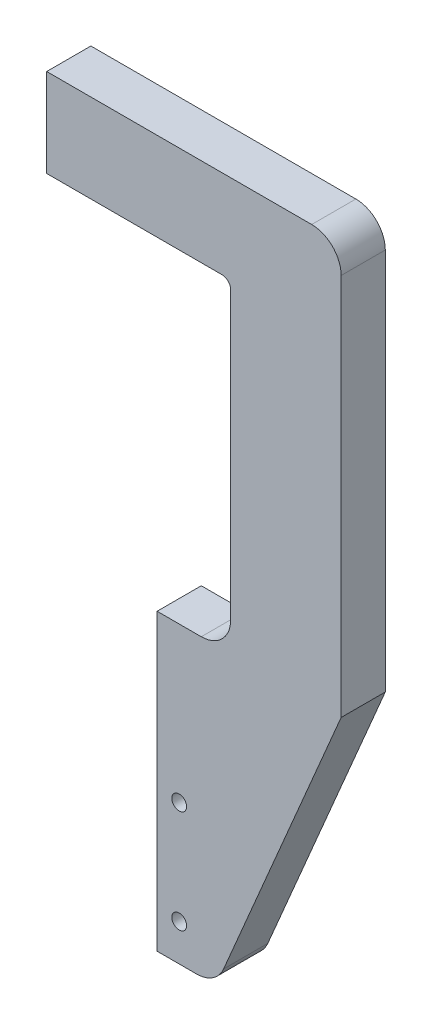
ISO-10303-21;
HEADER;
FILE_DESCRIPTION(('STEP AP214'),'2;1');
FILE_NAME('part.step','',(''),(''),'','','');
FILE_SCHEMA(('AUTOMOTIVE_DESIGN { 1 0 10303 214 1 1 1 1 }'));
ENDSEC;
DATA;
#1=APPLICATION_CONTEXT('core data for automotive mechanical design processes');
#2=APPLICATION_PROTOCOL_DEFINITION('international standard','automotive_design',2000,#1);
#3=PRODUCT_CONTEXT('',#1,'mechanical');
#4=PRODUCT('Part','Part','',(#3));
#5=PRODUCT_RELATED_PRODUCT_CATEGORY('part','',(#4));
#6=PRODUCT_DEFINITION_FORMATION('','',#4);
#7=PRODUCT_DEFINITION_CONTEXT('part definition',#1,'design');
#8=PRODUCT_DEFINITION('design','',#6,#7);
#9=PRODUCT_DEFINITION_SHAPE('','',#8);
#10=(LENGTH_UNIT() NAMED_UNIT(*) SI_UNIT(.MILLI.,.METRE.));
#11=(NAMED_UNIT(*) PLANE_ANGLE_UNIT() SI_UNIT($,.RADIAN.));
#12=(NAMED_UNIT(*) SI_UNIT($,.STERADIAN.) SOLID_ANGLE_UNIT());
#13=UNCERTAINTY_MEASURE_WITH_UNIT(LENGTH_MEASURE(1.E-05),#10,'distance_accuracy_value','');
#14=(GEOMETRIC_REPRESENTATION_CONTEXT(3) GLOBAL_UNCERTAINTY_ASSIGNED_CONTEXT((#13)) GLOBAL_UNIT_ASSIGNED_CONTEXT((#10,
#11,#12)) REPRESENTATION_CONTEXT('',''));
#15=CARTESIAN_POINT('',(0.,0.,0.));
#16=DIRECTION('',(0.,0.,1.));
#17=DIRECTION('',(1.,0.,0.));
#18=AXIS2_PLACEMENT_3D('',#15,#16,#17);
#19=CARTESIAN_POINT('',(0.,0.,7.5));
#20=DIRECTION('',(0.,1.,0.));
#21=DIRECTION('',(0.,0.,1.));
#22=AXIS2_PLACEMENT_3D('',#19,#20,#21);
#23=PLANE('',#22);
#24=CARTESIAN_POINT('',(40.,0.,0.));
#25=DIRECTION('',(0.,-1.,0.));
#26=DIRECTION('',(0.,0.,-1.));
#27=AXIS2_PLACEMENT_3D('',#24,#25,#26);
#28=CIRCLE('',#27,3.39999999999999);
#29=CARTESIAN_POINT('',(40.,0.,-3.39999999999999));
#30=VERTEX_POINT('',#29);
#31=EDGE_CURVE('E166',#30,#30,#28,.T.);
#32=ORIENTED_EDGE('',*,*,#31,.F.);
#33=EDGE_LOOP('',(#32));
#34=FACE_BOUND('',#33,.T.);
#35=CARTESIAN_POINT('',(10.,0.,0.));
#36=DIRECTION('',(0.,-1.,0.));
#37=DIRECTION('',(0.,0.,-1.));
#38=AXIS2_PLACEMENT_3D('',#35,#36,#37);
#39=CIRCLE('',#38,3.39999999999999);
#40=CARTESIAN_POINT('',(10.,0.,-3.39999999999999));
#41=VERTEX_POINT('',#40);
#42=EDGE_CURVE('E172',#41,#41,#39,.T.);
#43=ORIENTED_EDGE('',*,*,#42,.F.);
#44=EDGE_LOOP('',(#43));
#45=FACE_BOUND('',#44,.T.);
#46=DIRECTION('',(1.,0.,0.));
#47=VECTOR('',#46,1.);
#48=CARTESIAN_POINT('',(0.,0.,-7.5));
#49=LINE('',#48,#47);
#50=CARTESIAN_POINT('',(0.,0.,-7.5));
#51=VERTEX_POINT('',#50);
#52=CARTESIAN_POINT('',(59.5,0.,-7.5));
#53=VERTEX_POINT('',#52);
#54=EDGE_CURVE('E178',#51,#53,#49,.T.);
#55=ORIENTED_EDGE('',*,*,#54,.T.);
#56=DIRECTION('',(0.,0.,-1.));
#57=VECTOR('',#56,1.);
#58=CARTESIAN_POINT('',(59.5,0.,7.5));
#59=LINE('',#58,#57);
#60=CARTESIAN_POINT('',(59.5,0.,7.5));
#61=VERTEX_POINT('',#60);
#62=EDGE_CURVE('E53',#53,#61,#59,.F.);
#63=ORIENTED_EDGE('',*,*,#62,.T.);
#64=DIRECTION('',(1.,0.,0.));
#65=VECTOR('',#64,1.);
#66=CARTESIAN_POINT('',(0.,0.,7.5));
#67=LINE('',#66,#65);
#68=CARTESIAN_POINT('',(0.,0.,7.5));
#69=VERTEX_POINT('',#68);
#70=EDGE_CURVE('E179',#69,#61,#67,.T.);
#71=ORIENTED_EDGE('',*,*,#70,.F.);
#72=DIRECTION('',(0.,0.,-1.));
#73=VECTOR('',#72,1.);
#74=CARTESIAN_POINT('',(0.,0.,7.5));
#75=LINE('',#74,#73);
#76=EDGE_CURVE('E201',#69,#51,#75,.T.);
#77=ORIENTED_EDGE('',*,*,#76,.T.);
#78=EDGE_LOOP('',(#55,#63,#71,#77));
#79=FACE_BOUND('',#78,.T.);
#80=ADVANCED_FACE('F38',(#34,#45,#79),#23,.F.);
#81=CARTESIAN_POINT('',(62.5,-110.,7.5));
#82=DIRECTION('',(1.,0.,0.));
#83=DIRECTION('',(0.,1.,0.));
#84=AXIS2_PLACEMENT_3D('',#81,#82,#83);
#85=PLANE('',#84);
#86=DIRECTION('',(0.,-1.,0.));
#87=VECTOR('',#86,1.);
#88=CARTESIAN_POINT('',(62.5,-110.,7.5));
#89=LINE('',#88,#87);
#90=CARTESIAN_POINT('',(62.5,-3.,7.5));
#91=VERTEX_POINT('',#90);
#92=CARTESIAN_POINT('',(62.5,-100.,7.5));
#93=VERTEX_POINT('',#92);
#94=EDGE_CURVE('E181',#91,#93,#89,.T.);
#95=ORIENTED_EDGE('',*,*,#94,.F.);
#96=DIRECTION('',(0.,0.,-1.));
#97=VECTOR('',#96,1.);
#98=CARTESIAN_POINT('',(62.5,-3.,-7.5));
#99=LINE('',#98,#97);
#100=CARTESIAN_POINT('',(62.5,-3.,-7.5));
#101=VERTEX_POINT('',#100);
#102=EDGE_CURVE('E261',#91,#101,#99,.T.);
#103=ORIENTED_EDGE('',*,*,#102,.T.);
#104=DIRECTION('',(0.,-1.,0.));
#105=VECTOR('',#104,1.);
#106=CARTESIAN_POINT('',(62.5,-110.,-7.5));
#107=LINE('',#106,#105);
#108=CARTESIAN_POINT('',(62.5,-100.,-7.5));
#109=VERTEX_POINT('',#108);
#110=EDGE_CURVE('E203',#101,#109,#107,.T.);
#111=ORIENTED_EDGE('',*,*,#110,.T.);
#112=DIRECTION('',(0.,0.,-1.));
#113=VECTOR('',#112,1.);
#114=CARTESIAN_POINT('',(62.5,-100.,7.5));
#115=LINE('',#114,#113);
#116=EDGE_CURVE('E253',#109,#93,#115,.F.);
#117=ORIENTED_EDGE('',*,*,#116,.T.);
#118=EDGE_LOOP('',(#95,#103,#111,#117));
#119=FACE_BOUND('',#118,.T.);
#120=ADVANCED_FACE('F267',(#119),#85,.F.);
#121=CARTESIAN_POINT('',(62.5,-110.,7.5));
#122=DIRECTION('',(0.,-1.,0.));
#123=DIRECTION('',(1.,0.,0.));
#124=AXIS2_PLACEMENT_3D('',#121,#122,#123);
#125=PLANE('',#124);
#126=DIRECTION('',(-1.,0.,0.));
#127=VECTOR('',#126,1.);
#128=CARTESIAN_POINT('',(62.5,-110.,7.5));
#129=LINE('',#128,#127);
#130=CARTESIAN_POINT('',(52.5,-110.,7.5));
#131=VERTEX_POINT('',#130);
#132=CARTESIAN_POINT('',(37.5,-110.,7.5));
#133=VERTEX_POINT('',#132);
#134=EDGE_CURVE('E184',#131,#133,#129,.T.);
#135=ORIENTED_EDGE('',*,*,#134,.F.);
#136=DIRECTION('',(0.,0.,-1.));
#137=VECTOR('',#136,1.);
#138=CARTESIAN_POINT('',(52.5,-110.,-7.5));
#139=LINE('',#138,#137);
#140=CARTESIAN_POINT('',(52.5,-110.,-7.5));
#141=VERTEX_POINT('',#140);
#142=EDGE_CURVE('E250',#131,#141,#139,.T.);
#143=ORIENTED_EDGE('',*,*,#142,.T.);
#144=DIRECTION('',(-1.,0.,0.));
#145=VECTOR('',#144,1.);
#146=CARTESIAN_POINT('',(62.5,-110.,-7.5));
#147=LINE('',#146,#145);
#148=CARTESIAN_POINT('',(37.5,-110.,-7.5));
#149=VERTEX_POINT('',#148);
#150=EDGE_CURVE('E205',#141,#149,#147,.T.);
#151=ORIENTED_EDGE('',*,*,#150,.T.);
#152=DIRECTION('',(0.,0.,-1.));
#153=VECTOR('',#152,1.);
#154=CARTESIAN_POINT('',(37.5,-110.,7.5));
#155=LINE('',#154,#153);
#156=EDGE_CURVE('E238',#133,#149,#155,.T.);
#157=ORIENTED_EDGE('',*,*,#156,.F.);
#158=EDGE_LOOP('',(#135,#143,#151,#157));
#159=FACE_BOUND('',#158,.T.);
#160=ADVANCED_FACE('F284',(#159),#125,.F.);
#161=CARTESIAN_POINT('',(37.5,-110.,7.5));
#162=DIRECTION('',(1.,0.,0.));
#163=DIRECTION('',(0.,1.,0.));
#164=AXIS2_PLACEMENT_3D('',#161,#162,#163);
#165=PLANE('',#164);
#166=CARTESIAN_POINT('',(37.5,-130.,0.));
#167=DIRECTION('',(-1.,0.,0.));
#168=DIRECTION('',(0.,0.,1.));
#169=AXIS2_PLACEMENT_3D('',#166,#167,#168);
#170=CIRCLE('',#169,3.39999999999999);
#171=CARTESIAN_POINT('',(37.5,-130.,3.4));
#172=VERTEX_POINT('',#171);
#173=EDGE_CURVE('E154',#172,#172,#170,.T.);
#174=ORIENTED_EDGE('',*,*,#173,.F.);
#175=EDGE_LOOP('',(#174));
#176=FACE_BOUND('',#175,.T.);
#177=CARTESIAN_POINT('',(37.5,-190.,0.));
#178=DIRECTION('',(-1.,0.,0.));
#179=DIRECTION('',(0.,0.,1.));
#180=AXIS2_PLACEMENT_3D('',#177,#178,#179);
#181=CIRCLE('',#180,3.39999999999999);
#182=CARTESIAN_POINT('',(37.5,-190.,3.40000000000001));
#183=VERTEX_POINT('',#182);
#184=EDGE_CURVE('E153',#183,#183,#181,.T.);
#185=ORIENTED_EDGE('',*,*,#184,.F.);
#186=EDGE_LOOP('',(#185));
#187=FACE_BOUND('',#186,.T.);
#188=DIRECTION('',(0.,-1.,0.));
#189=VECTOR('',#188,1.);
#190=CARTESIAN_POINT('',(37.5,-110.,-7.5));
#191=LINE('',#190,#189);
#192=CARTESIAN_POINT('',(37.5,-210.,-7.5));
#193=VERTEX_POINT('',#192);
#194=EDGE_CURVE('E207',#149,#193,#191,.T.);
#195=ORIENTED_EDGE('',*,*,#194,.T.);
#196=DIRECTION('',(0.,0.,-1.));
#197=VECTOR('',#196,1.);
#198=CARTESIAN_POINT('',(37.5,-210.,7.5));
#199=LINE('',#198,#197);
#200=CARTESIAN_POINT('',(37.5,-210.,7.5));
#201=VERTEX_POINT('',#200);
#202=EDGE_CURVE('E235',#201,#193,#199,.T.);
#203=ORIENTED_EDGE('',*,*,#202,.F.);
#204=DIRECTION('',(0.,-1.,0.));
#205=VECTOR('',#204,1.);
#206=CARTESIAN_POINT('',(37.5,-110.,7.5));
#207=LINE('',#206,#205);
#208=EDGE_CURVE('E186',#133,#201,#207,.T.);
#209=ORIENTED_EDGE('',*,*,#208,.F.);
#210=ORIENTED_EDGE('',*,*,#156,.T.);
#211=EDGE_LOOP('',(#195,#203,#209,#210));
#212=FACE_BOUND('',#211,.T.);
#213=ADVANCED_FACE('F288',(#176,#187,#212),#165,.F.);
#214=CARTESIAN_POINT('',(57.5,-210.,7.5));
#215=DIRECTION('',(0.,1.,0.));
#216=DIRECTION('',(0.,0.,1.));
#217=AXIS2_PLACEMENT_3D('',#214,#215,#216);
#218=PLANE('',#217);
#219=DIRECTION('',(1.,0.,0.));
#220=VECTOR('',#219,1.);
#221=CARTESIAN_POINT('',(57.5,-210.,-7.5));
#222=LINE('',#221,#220);
#223=CARTESIAN_POINT('',(50.8843430939496,-210.,-7.5));
#224=VERTEX_POINT('',#223);
#225=EDGE_CURVE('E209',#193,#224,#222,.T.);
#226=ORIENTED_EDGE('',*,*,#225,.T.);
#227=DIRECTION('',(0.,0.,-1.));
#228=VECTOR('',#227,1.);
#229=CARTESIAN_POINT('',(50.8843430939496,-210.,7.5));
#230=LINE('',#229,#228);
#231=CARTESIAN_POINT('',(50.8843430939496,-210.,7.5));
#232=VERTEX_POINT('',#231);
#233=EDGE_CURVE('E246',#224,#232,#230,.F.);
#234=ORIENTED_EDGE('',*,*,#233,.T.);
#235=DIRECTION('',(1.,0.,0.));
#236=VECTOR('',#235,1.);
#237=CARTESIAN_POINT('',(57.5,-210.,7.5));
#238=LINE('',#237,#236);
#239=EDGE_CURVE('E188',#201,#232,#238,.T.);
#240=ORIENTED_EDGE('',*,*,#239,.F.);
#241=ORIENTED_EDGE('',*,*,#202,.T.);
#242=EDGE_LOOP('',(#226,#234,#240,#241));
#243=FACE_BOUND('',#242,.T.);
#244=ADVANCED_FACE('F390',(#243),#218,.F.);
#245=CARTESIAN_POINT('',(100.,-110.,7.5));
#246=DIRECTION('',(-0.920330918458474,0.391140640344852,0.));
#247=DIRECTION('',(-0.391140640344852,-0.920330918458474,0.));
#248=AXIS2_PLACEMENT_3D('',#245,#246,#247);
#249=PLANE('',#248);
#250=DIRECTION('',(0.391140640344852,0.920330918458474,0.));
#251=VECTOR('',#250,1.);
#252=CARTESIAN_POINT('',(100.,-110.,7.5));
#253=LINE('',#252,#251);
#254=CARTESIAN_POINT('',(60.0876522785344,-203.911406403448,7.5));
#255=VERTEX_POINT('',#254);
#256=CARTESIAN_POINT('',(100.,-110.,7.5));
#257=VERTEX_POINT('',#256);
#258=EDGE_CURVE('E191',#255,#257,#253,.T.);
#259=ORIENTED_EDGE('',*,*,#258,.F.);
#260=DIRECTION('',(0.,0.,-1.));
#261=VECTOR('',#260,1.);
#262=CARTESIAN_POINT('',(60.0876522785344,-203.911406403448,7.5));
#263=LINE('',#262,#261);
#264=CARTESIAN_POINT('',(60.0876522785344,-203.911406403448,-7.5));
#265=VERTEX_POINT('',#264);
#266=EDGE_CURVE('E241',#255,#265,#263,.T.);
#267=ORIENTED_EDGE('',*,*,#266,.T.);
#268=DIRECTION('',(0.391140640344852,0.920330918458474,0.));
#269=VECTOR('',#268,1.);
#270=CARTESIAN_POINT('',(100.,-110.,-7.5));
#271=LINE('',#270,#269);
#272=CARTESIAN_POINT('',(100.,-110.,-7.5));
#273=VERTEX_POINT('',#272);
#274=EDGE_CURVE('E212',#265,#273,#271,.T.);
#275=ORIENTED_EDGE('',*,*,#274,.T.);
#276=DIRECTION('',(0.,0.,-1.));
#277=VECTOR('',#276,1.);
#278=CARTESIAN_POINT('',(100.,-110.,7.5));
#279=LINE('',#278,#277);
#280=EDGE_CURVE('E232',#257,#273,#279,.T.);
#281=ORIENTED_EDGE('',*,*,#280,.F.);
#282=EDGE_LOOP('',(#259,#267,#275,#281));
#283=FACE_BOUND('',#282,.T.);
#284=ADVANCED_FACE('F298',(#283),#249,.F.);
#285=CARTESIAN_POINT('',(100.,20.,7.5));
#286=DIRECTION('',(-1.,0.,0.));
#287=DIRECTION('',(0.,-1.,0.));
#288=AXIS2_PLACEMENT_3D('',#285,#286,#287);
#289=PLANE('',#288);
#290=DIRECTION('',(0.,1.,0.));
#291=VECTOR('',#290,1.);
#292=CARTESIAN_POINT('',(100.,20.,-7.5));
#293=LINE('',#292,#291);
#294=CARTESIAN_POINT('',(100.,20.,-7.5));
#295=VERTEX_POINT('',#294);
#296=EDGE_CURVE('E214',#273,#295,#293,.T.);
#297=ORIENTED_EDGE('',*,*,#296,.T.);
#298=DIRECTION('',(0.,0.,-1.));
#299=VECTOR('',#298,1.);
#300=CARTESIAN_POINT('',(100.,20.,7.5));
#301=LINE('',#300,#299);
#302=CARTESIAN_POINT('',(100.,20.,7.5));
#303=VERTEX_POINT('',#302);
#304=EDGE_CURVE('E229',#303,#295,#301,.T.);
#305=ORIENTED_EDGE('',*,*,#304,.F.);
#306=DIRECTION('',(0.,1.,0.));
#307=VECTOR('',#306,1.);
#308=CARTESIAN_POINT('',(100.,20.,7.5));
#309=LINE('',#308,#307);
#310=EDGE_CURVE('E193',#257,#303,#309,.T.);
#311=ORIENTED_EDGE('',*,*,#310,.F.);
#312=ORIENTED_EDGE('',*,*,#280,.T.);
#313=EDGE_LOOP('',(#297,#305,#311,#312));
#314=FACE_BOUND('',#313,.T.);
#315=ADVANCED_FACE('F306',(#314),#289,.F.);
#316=CARTESIAN_POINT('',(90.,20.,7.5));
#317=DIRECTION('',(0.,0.,-1.));
#318=DIRECTION('',(-1.,0.,0.));
#319=AXIS2_PLACEMENT_3D('',#316,#317,#318);
#320=CYLINDRICAL_SURFACE('',#319,10.);
#321=CARTESIAN_POINT('',(90.,20.,-7.5));
#322=DIRECTION('',(0.,0.,1.));
#323=DIRECTION('',(1.,0.,0.));
#324=AXIS2_PLACEMENT_3D('',#321,#322,#323);
#325=CIRCLE('',#324,10.);
#326=CARTESIAN_POINT('',(90.,30.,-7.5));
#327=VERTEX_POINT('',#326);
#328=EDGE_CURVE('E216',#295,#327,#325,.T.);
#329=ORIENTED_EDGE('',*,*,#328,.T.);
#330=DIRECTION('',(0.,0.,-1.));
#331=VECTOR('',#330,1.);
#332=CARTESIAN_POINT('',(90.,30.,7.5));
#333=LINE('',#332,#331);
#334=CARTESIAN_POINT('',(90.,30.,7.5));
#335=VERTEX_POINT('',#334);
#336=EDGE_CURVE('E226',#335,#327,#333,.T.);
#337=ORIENTED_EDGE('',*,*,#336,.F.);
#338=CARTESIAN_POINT('',(90.,20.,7.5));
#339=DIRECTION('',(0.,0.,1.));
#340=DIRECTION('',(1.,0.,0.));
#341=AXIS2_PLACEMENT_3D('',#338,#339,#340);
#342=CIRCLE('',#341,10.);
#343=EDGE_CURVE('E195',#303,#335,#342,.T.);
#344=ORIENTED_EDGE('',*,*,#343,.F.);
#345=ORIENTED_EDGE('',*,*,#304,.T.);
#346=EDGE_LOOP('',(#329,#337,#344,#345));
#347=FACE_BOUND('',#346,.T.);
#348=ADVANCED_FACE('F310',(#347),#320,.T.);
#349=CARTESIAN_POINT('',(0.,30.,7.5));
#350=DIRECTION('',(0.,-1.,0.));
#351=DIRECTION('',(0.,0.,-1.));
#352=AXIS2_PLACEMENT_3D('',#349,#350,#351);
#353=PLANE('',#352);
#354=DIRECTION('',(-1.,0.,0.));
#355=VECTOR('',#354,1.);
#356=CARTESIAN_POINT('',(0.,30.,-7.5));
#357=LINE('',#356,#355);
#358=CARTESIAN_POINT('',(0.,30.,-7.5));
#359=VERTEX_POINT('',#358);
#360=EDGE_CURVE('E218',#327,#359,#357,.T.);
#361=ORIENTED_EDGE('',*,*,#360,.T.);
#362=DIRECTION('',(0.,0.,-1.));
#363=VECTOR('',#362,1.);
#364=CARTESIAN_POINT('',(0.,30.,7.5));
#365=LINE('',#364,#363);
#366=CARTESIAN_POINT('',(0.,30.,7.5));
#367=VERTEX_POINT('',#366);
#368=EDGE_CURVE('E223',#367,#359,#365,.T.);
#369=ORIENTED_EDGE('',*,*,#368,.F.);
#370=DIRECTION('',(-1.,0.,0.));
#371=VECTOR('',#370,1.);
#372=CARTESIAN_POINT('',(0.,30.,7.5));
#373=LINE('',#372,#371);
#374=EDGE_CURVE('E197',#335,#367,#373,.T.);
#375=ORIENTED_EDGE('',*,*,#374,.F.);
#376=ORIENTED_EDGE('',*,*,#336,.T.);
#377=EDGE_LOOP('',(#361,#369,#375,#376));
#378=FACE_BOUND('',#377,.T.);
#379=ADVANCED_FACE('F317',(#378),#353,.F.);
#380=CARTESIAN_POINT('',(0.,0.,7.5));
#381=DIRECTION('',(1.,0.,0.));
#382=DIRECTION('',(0.,0.,-1.));
#383=AXIS2_PLACEMENT_3D('',#380,#381,#382);
#384=PLANE('',#383);
#385=DIRECTION('',(0.,-1.,0.));
#386=VECTOR('',#385,1.);
#387=CARTESIAN_POINT('',(0.,0.,-7.5));
#388=LINE('',#387,#386);
#389=EDGE_CURVE('E182',#359,#51,#388,.T.);
#390=ORIENTED_EDGE('',*,*,#389,.T.);
#391=ORIENTED_EDGE('',*,*,#76,.F.);
#392=DIRECTION('',(0.,-1.,0.));
#393=VECTOR('',#392,1.);
#394=CARTESIAN_POINT('',(0.,0.,7.5));
#395=LINE('',#394,#393);
#396=EDGE_CURVE('E199',#367,#69,#395,.T.);
#397=ORIENTED_EDGE('',*,*,#396,.F.);
#398=ORIENTED_EDGE('',*,*,#368,.T.);
#399=EDGE_LOOP('',(#390,#391,#397,#398));
#400=FACE_BOUND('',#399,.T.);
#401=ADVANCED_FACE('F320',(#400),#384,.F.);
#402=CARTESIAN_POINT('',(90.,20.,7.5));
#403=DIRECTION('',(0.,0.,1.));
#404=DIRECTION('',(1.,0.,0.));
#405=AXIS2_PLACEMENT_3D('',#402,#403,#404);
#406=PLANE('',#405);
#407=CARTESIAN_POINT('',(45.,-162.5,7.5));
#408=DIRECTION('',(0.,0.,1.));
#409=DIRECTION('',(1.,0.,0.));
#410=AXIS2_PLACEMENT_3D('',#407,#408,#409);
#411=CIRCLE('',#410,2.49999999999999);
#412=CARTESIAN_POINT('',(47.5,-162.5,7.5));
#413=VERTEX_POINT('',#412);
#414=EDGE_CURVE('E549',#413,#413,#411,.T.);
#415=ORIENTED_EDGE('',*,*,#414,.F.);
#416=EDGE_LOOP('',(#415));
#417=FACE_BOUND('',#416,.T.);
#418=CARTESIAN_POINT('',(45.,-197.5,7.5));
#419=DIRECTION('',(0.,0.,1.));
#420=DIRECTION('',(1.,0.,0.));
#421=AXIS2_PLACEMENT_3D('',#418,#419,#420);
#422=CIRCLE('',#421,2.49999999999999);
#423=CARTESIAN_POINT('',(47.5,-197.5,7.5));
#424=VERTEX_POINT('',#423);
#425=EDGE_CURVE('E551',#424,#424,#422,.T.);
#426=ORIENTED_EDGE('',*,*,#425,.F.);
#427=EDGE_LOOP('',(#426));
#428=FACE_BOUND('',#427,.T.);
#429=ORIENTED_EDGE('',*,*,#239,.T.);
#430=CARTESIAN_POINT('',(50.8843430939496,-200.,7.5));
#431=DIRECTION('',(0.,0.,1.));
#432=DIRECTION('',(1.,0.,0.));
#433=AXIS2_PLACEMENT_3D('',#430,#431,#432);
#434=CIRCLE('',#433,10.);
#435=EDGE_CURVE('E248',#232,#255,#434,.T.);
#436=ORIENTED_EDGE('',*,*,#435,.T.);
#437=ORIENTED_EDGE('',*,*,#258,.T.);
#438=ORIENTED_EDGE('',*,*,#310,.T.);
#439=ORIENTED_EDGE('',*,*,#343,.T.);
#440=ORIENTED_EDGE('',*,*,#374,.T.);
#441=ORIENTED_EDGE('',*,*,#396,.T.);
#442=ORIENTED_EDGE('',*,*,#70,.T.);
#443=CARTESIAN_POINT('',(59.5,-3.,7.5));
#444=DIRECTION('',(0.,0.,1.));
#445=DIRECTION('',(1.,0.,0.));
#446=AXIS2_PLACEMENT_3D('',#443,#444,#445);
#447=CIRCLE('',#446,3.);
#448=EDGE_CURVE('E11',#61,#91,#447,.F.);
#449=ORIENTED_EDGE('',*,*,#448,.T.);
#450=ORIENTED_EDGE('',*,*,#94,.T.);
#451=CARTESIAN_POINT('',(52.5,-100.,7.5));
#452=DIRECTION('',(0.,0.,1.));
#453=DIRECTION('',(1.,0.,0.));
#454=AXIS2_PLACEMENT_3D('',#451,#452,#453);
#455=CIRCLE('',#454,10.);
#456=EDGE_CURVE('E259',#93,#131,#455,.F.);
#457=ORIENTED_EDGE('',*,*,#456,.T.);
#458=ORIENTED_EDGE('',*,*,#134,.T.);
#459=ORIENTED_EDGE('',*,*,#208,.T.);
#460=EDGE_LOOP('',(#429,#436,#437,#438,#439,#440,#441,#442,#449,#450,#457,#458,#459));
#461=FACE_BOUND('',#460,.T.);
#462=ADVANCED_FACE('F281',(#417,#428,#461),#406,.T.);
#463=CARTESIAN_POINT('',(90.,20.,-7.5));
#464=DIRECTION('',(0.,0.,1.));
#465=DIRECTION('',(1.,0.,0.));
#466=AXIS2_PLACEMENT_3D('',#463,#464,#465);
#467=PLANE('',#466);
#468=CARTESIAN_POINT('',(45.,-162.5,-7.5));
#469=DIRECTION('',(0.,0.,1.));
#470=DIRECTION('',(1.,0.,0.));
#471=AXIS2_PLACEMENT_3D('',#468,#469,#470);
#472=CIRCLE('',#471,2.49999999999999);
#473=CARTESIAN_POINT('',(47.5,-162.5,-7.5));
#474=VERTEX_POINT('',#473);
#475=EDGE_CURVE('E546',#474,#474,#472,.T.);
#476=ORIENTED_EDGE('',*,*,#475,.T.);
#477=EDGE_LOOP('',(#476));
#478=FACE_BOUND('',#477,.T.);
#479=CARTESIAN_POINT('',(45.,-197.5,-7.5));
#480=DIRECTION('',(0.,0.,1.));
#481=DIRECTION('',(1.,0.,0.));
#482=AXIS2_PLACEMENT_3D('',#479,#480,#481);
#483=CIRCLE('',#482,2.49999999999999);
#484=CARTESIAN_POINT('',(47.5,-197.5,-7.5));
#485=VERTEX_POINT('',#484);
#486=EDGE_CURVE('E160',#485,#485,#483,.T.);
#487=ORIENTED_EDGE('',*,*,#486,.T.);
#488=EDGE_LOOP('',(#487));
#489=FACE_BOUND('',#488,.T.);
#490=ORIENTED_EDGE('',*,*,#274,.F.);
#491=CARTESIAN_POINT('',(50.8843430939496,-200.,-7.5));
#492=DIRECTION('',(0.,0.,1.));
#493=DIRECTION('',(1.,0.,0.));
#494=AXIS2_PLACEMENT_3D('',#491,#492,#493);
#495=CIRCLE('',#494,10.);
#496=EDGE_CURVE('E244',#265,#224,#495,.F.);
#497=ORIENTED_EDGE('',*,*,#496,.T.);
#498=ORIENTED_EDGE('',*,*,#225,.F.);
#499=ORIENTED_EDGE('',*,*,#194,.F.);
#500=ORIENTED_EDGE('',*,*,#150,.F.);
#501=CARTESIAN_POINT('',(52.5,-100.,-7.5));
#502=DIRECTION('',(0.,0.,1.));
#503=DIRECTION('',(1.,0.,0.));
#504=AXIS2_PLACEMENT_3D('',#501,#502,#503);
#505=CIRCLE('',#504,10.);
#506=EDGE_CURVE('E256',#141,#109,#505,.T.);
#507=ORIENTED_EDGE('',*,*,#506,.T.);
#508=ORIENTED_EDGE('',*,*,#110,.F.);
#509=CARTESIAN_POINT('',(59.5,-3.,-7.5));
#510=DIRECTION('',(0.,0.,1.));
#511=DIRECTION('',(1.,0.,0.));
#512=AXIS2_PLACEMENT_3D('',#509,#510,#511);
#513=CIRCLE('',#512,3.);
#514=EDGE_CURVE('E46',#101,#53,#513,.T.);
#515=ORIENTED_EDGE('',*,*,#514,.T.);
#516=ORIENTED_EDGE('',*,*,#54,.F.);
#517=ORIENTED_EDGE('',*,*,#389,.F.);
#518=ORIENTED_EDGE('',*,*,#360,.F.);
#519=ORIENTED_EDGE('',*,*,#328,.F.);
#520=ORIENTED_EDGE('',*,*,#296,.F.);
#521=EDGE_LOOP('',(#490,#497,#498,#499,#500,#507,#508,#515,#516,#517,#518,#519,#520));
#522=FACE_BOUND('',#521,.T.);
#523=ADVANCED_FACE('F271',(#478,#489,#522),#467,.F.);
#524=CARTESIAN_POINT('',(10.,19.75,0.));
#525=DIRECTION('',(0.,-1.,0.));
#526=DIRECTION('',(0.,0.,-1.));
#527=AXIS2_PLACEMENT_3D('',#524,#525,#526);
#528=CONICAL_SURFACE('',#527,3.39999999999999,1.02974425867665);
#529=CARTESIAN_POINT('',(9.99999999999999,21.7929261046937,0.));
#530=VERTEX_POINT('',#529);
#531=VERTEX_LOOP('',#530);
#532=FACE_BOUND('',#531,.T.);
#533=CARTESIAN_POINT('',(10.,19.75,0.));
#534=DIRECTION('',(0.,-1.,0.));
#535=DIRECTION('',(0.,0.,-1.));
#536=AXIS2_PLACEMENT_3D('',#533,#534,#535);
#537=CIRCLE('',#536,3.39999999999999);
#538=CARTESIAN_POINT('',(10.,19.75,-3.39999999999998));
#539=VERTEX_POINT('',#538);
#540=EDGE_CURVE('E175',#539,#539,#537,.T.);
#541=ORIENTED_EDGE('',*,*,#540,.T.);
#542=EDGE_LOOP('',(#541));
#543=FACE_BOUND('',#542,.T.);
#544=ADVANCED_FACE('F369',(#532,#543),#528,.F.);
#545=CARTESIAN_POINT('',(10.,0.,0.));
#546=DIRECTION('',(0.,-1.,0.));
#547=DIRECTION('',(0.,0.,-1.));
#548=AXIS2_PLACEMENT_3D('',#545,#546,#547);
#549=CYLINDRICAL_SURFACE('',#548,3.39999999999999);
#550=ORIENTED_EDGE('',*,*,#540,.F.);
#551=EDGE_LOOP('',(#550));
#552=FACE_BOUND('',#551,.T.);
#553=ORIENTED_EDGE('',*,*,#42,.T.);
#554=EDGE_LOOP('',(#553));
#555=FACE_BOUND('',#554,.T.);
#556=ADVANCED_FACE('F365',(#552,#555),#549,.F.);
#557=CARTESIAN_POINT('',(40.,19.75,0.));
#558=DIRECTION('',(0.,-1.,0.));
#559=DIRECTION('',(0.,0.,-1.));
#560=AXIS2_PLACEMENT_3D('',#557,#558,#559);
#561=CONICAL_SURFACE('',#560,3.39999999999999,1.02974425867665);
#562=CARTESIAN_POINT('',(40.,21.7929261046937,0.));
#563=VERTEX_POINT('',#562);
#564=VERTEX_LOOP('',#563);
#565=FACE_BOUND('',#564,.T.);
#566=CARTESIAN_POINT('',(40.,19.75,0.));
#567=DIRECTION('',(0.,-1.,0.));
#568=DIRECTION('',(0.,0.,-1.));
#569=AXIS2_PLACEMENT_3D('',#566,#567,#568);
#570=CIRCLE('',#569,3.39999999999999);
#571=CARTESIAN_POINT('',(40.,19.75,-3.39999999999998));
#572=VERTEX_POINT('',#571);
#573=EDGE_CURVE('E169',#572,#572,#570,.T.);
#574=ORIENTED_EDGE('',*,*,#573,.T.);
#575=EDGE_LOOP('',(#574));
#576=FACE_BOUND('',#575,.T.);
#577=ADVANCED_FACE('F361',(#565,#576),#561,.F.);
#578=CARTESIAN_POINT('',(40.,0.,0.));
#579=DIRECTION('',(0.,-1.,0.));
#580=DIRECTION('',(0.,0.,-1.));
#581=AXIS2_PLACEMENT_3D('',#578,#579,#580);
#582=CYLINDRICAL_SURFACE('',#581,3.39999999999999);
#583=ORIENTED_EDGE('',*,*,#573,.F.);
#584=EDGE_LOOP('',(#583));
#585=FACE_BOUND('',#584,.T.);
#586=ORIENTED_EDGE('',*,*,#31,.T.);
#587=EDGE_LOOP('',(#586));
#588=FACE_BOUND('',#587,.T.);
#589=ADVANCED_FACE('F357',(#585,#588),#582,.F.);
#590=CARTESIAN_POINT('',(57.25,-190.,0.));
#591=DIRECTION('',(-1.,0.,0.));
#592=DIRECTION('',(0.,0.,1.));
#593=AXIS2_PLACEMENT_3D('',#590,#591,#592);
#594=CONICAL_SURFACE('',#593,3.39999999999999,1.02974425867665);
#595=CARTESIAN_POINT('',(59.2929261046937,-190.,0.));
#596=VERTEX_POINT('',#595);
#597=VERTEX_LOOP('',#596);
#598=FACE_BOUND('',#597,.T.);
#599=CARTESIAN_POINT('',(57.25,-190.,0.));
#600=DIRECTION('',(-1.,0.,0.));
#601=DIRECTION('',(0.,0.,1.));
#602=AXIS2_PLACEMENT_3D('',#599,#600,#601);
#603=CIRCLE('',#602,3.39999999999999);
#604=CARTESIAN_POINT('',(57.25,-190.,3.40000000000001));
#605=VERTEX_POINT('',#604);
#606=EDGE_CURVE('E157',#605,#605,#603,.T.);
#607=ORIENTED_EDGE('',*,*,#606,.T.);
#608=EDGE_LOOP('',(#607));
#609=FACE_BOUND('',#608,.T.);
#610=ADVANCED_FACE('F353',(#598,#609),#594,.F.);
#611=CARTESIAN_POINT('',(37.5,-190.,0.));
#612=DIRECTION('',(-1.,0.,0.));
#613=DIRECTION('',(0.,0.,1.));
#614=AXIS2_PLACEMENT_3D('',#611,#612,#613);
#615=CYLINDRICAL_SURFACE('',#614,3.39999999999999);
#616=ORIENTED_EDGE('',*,*,#606,.F.);
#617=EDGE_LOOP('',(#616));
#618=FACE_BOUND('',#617,.T.);
#619=ORIENTED_EDGE('',*,*,#184,.T.);
#620=EDGE_LOOP('',(#619));
#621=FACE_BOUND('',#620,.T.);
#622=ADVANCED_FACE('F147',(#618,#621),#615,.F.);
#623=CARTESIAN_POINT('',(57.25,-130.,0.));
#624=DIRECTION('',(-1.,0.,0.));
#625=DIRECTION('',(0.,0.,1.));
#626=AXIS2_PLACEMENT_3D('',#623,#624,#625);
#627=CONICAL_SURFACE('',#626,3.39999999999999,1.02974425867665);
#628=CARTESIAN_POINT('',(59.2929261046937,-130.,0.));
#629=VERTEX_POINT('',#628);
#630=VERTEX_LOOP('',#629);
#631=FACE_BOUND('',#630,.T.);
#632=CARTESIAN_POINT('',(57.25,-130.,0.));
#633=DIRECTION('',(-1.,0.,0.));
#634=DIRECTION('',(0.,0.,1.));
#635=AXIS2_PLACEMENT_3D('',#632,#633,#634);
#636=CIRCLE('',#635,3.39999999999999);
#637=CARTESIAN_POINT('',(57.25,-130.,3.4));
#638=VERTEX_POINT('',#637);
#639=EDGE_CURVE('E151',#638,#638,#636,.T.);
#640=ORIENTED_EDGE('',*,*,#639,.T.);
#641=EDGE_LOOP('',(#640));
#642=FACE_BOUND('',#641,.T.);
#643=ADVANCED_FACE('F143',(#631,#642),#627,.F.);
#644=CARTESIAN_POINT('',(37.5,-130.,0.));
#645=DIRECTION('',(-1.,0.,0.));
#646=DIRECTION('',(0.,0.,1.));
#647=AXIS2_PLACEMENT_3D('',#644,#645,#646);
#648=CYLINDRICAL_SURFACE('',#647,3.39999999999999);
#649=ORIENTED_EDGE('',*,*,#639,.F.);
#650=EDGE_LOOP('',(#649));
#651=FACE_BOUND('',#650,.T.);
#652=ORIENTED_EDGE('',*,*,#173,.T.);
#653=EDGE_LOOP('',(#652));
#654=FACE_BOUND('',#653,.T.);
#655=ADVANCED_FACE('F146',(#651,#654),#648,.F.);
#656=CARTESIAN_POINT('',(50.8843430939496,-200.,7.5));
#657=DIRECTION('',(0.,0.,-1.));
#658=DIRECTION('',(-1.,0.,0.));
#659=AXIS2_PLACEMENT_3D('',#656,#657,#658);
#660=CYLINDRICAL_SURFACE('',#659,10.);
#661=ORIENTED_EDGE('',*,*,#435,.F.);
#662=ORIENTED_EDGE('',*,*,#233,.F.);
#663=ORIENTED_EDGE('',*,*,#496,.F.);
#664=ORIENTED_EDGE('',*,*,#266,.F.);
#665=EDGE_LOOP('',(#661,#662,#663,#664));
#666=FACE_BOUND('',#665,.T.);
#667=ADVANCED_FACE('F296',(#666),#660,.T.);
#668=CARTESIAN_POINT('',(52.5,-100.,7.5));
#669=DIRECTION('',(0.,0.,1.));
#670=DIRECTION('',(1.,0.,0.));
#671=AXIS2_PLACEMENT_3D('',#668,#669,#670);
#672=CYLINDRICAL_SURFACE('',#671,10.);
#673=ORIENTED_EDGE('',*,*,#456,.F.);
#674=ORIENTED_EDGE('',*,*,#116,.F.);
#675=ORIENTED_EDGE('',*,*,#506,.F.);
#676=ORIENTED_EDGE('',*,*,#142,.F.);
#677=EDGE_LOOP('',(#673,#674,#675,#676));
#678=FACE_BOUND('',#677,.T.);
#679=ADVANCED_FACE('F278',(#678),#672,.F.);
#680=CARTESIAN_POINT('',(59.5,-3.,7.5));
#681=DIRECTION('',(0.,0.,1.));
#682=DIRECTION('',(1.,0.,0.));
#683=AXIS2_PLACEMENT_3D('',#680,#681,#682);
#684=CYLINDRICAL_SURFACE('',#683,3.);
#685=ORIENTED_EDGE('',*,*,#448,.F.);
#686=ORIENTED_EDGE('',*,*,#62,.F.);
#687=ORIENTED_EDGE('',*,*,#514,.F.);
#688=ORIENTED_EDGE('',*,*,#102,.F.);
#689=EDGE_LOOP('',(#685,#686,#687,#688));
#690=FACE_BOUND('',#689,.T.);
#691=ADVANCED_FACE('F40',(#690),#684,.F.);
#692=CARTESIAN_POINT('',(45.,-197.5,7.5));
#693=DIRECTION('',(0.,0.,1.));
#694=DIRECTION('',(1.,0.,0.));
#695=AXIS2_PLACEMENT_3D('',#692,#693,#694);
#696=CYLINDRICAL_SURFACE('',#695,2.49999999999999);
#697=ORIENTED_EDGE('',*,*,#486,.F.);
#698=EDGE_LOOP('',(#697));
#699=FACE_BOUND('',#698,.T.);
#700=ORIENTED_EDGE('',*,*,#425,.T.);
#701=EDGE_LOOP('',(#700));
#702=FACE_BOUND('',#701,.T.);
#703=ADVANCED_FACE('F322',(#699,#702),#696,.F.);
#704=CARTESIAN_POINT('',(45.,-162.5,7.5));
#705=DIRECTION('',(0.,0.,1.));
#706=DIRECTION('',(1.,0.,0.));
#707=AXIS2_PLACEMENT_3D('',#704,#705,#706);
#708=CYLINDRICAL_SURFACE('',#707,2.49999999999999);
#709=ORIENTED_EDGE('',*,*,#475,.F.);
#710=EDGE_LOOP('',(#709));
#711=FACE_BOUND('',#710,.T.);
#712=ORIENTED_EDGE('',*,*,#414,.T.);
#713=EDGE_LOOP('',(#712));
#714=FACE_BOUND('',#713,.T.);
#715=ADVANCED_FACE('F327',(#711,#714),#708,.F.);
#716=CLOSED_SHELL('',(#80,#120,#160,#213,#244,#284,#315,#348,#379,#401,#462,#523,#544,#556,#577,
#589,#610,#622,#643,#655,#667,#679,#691,#703,#715));
#717=MANIFOLD_SOLID_BREP('B2',#716);
#718=ADVANCED_BREP_SHAPE_REPRESENTATION('',(#18,#717),#14);
#719=SHAPE_DEFINITION_REPRESENTATION(#9,#718);
ENDSEC;
END-ISO-10303-21;
